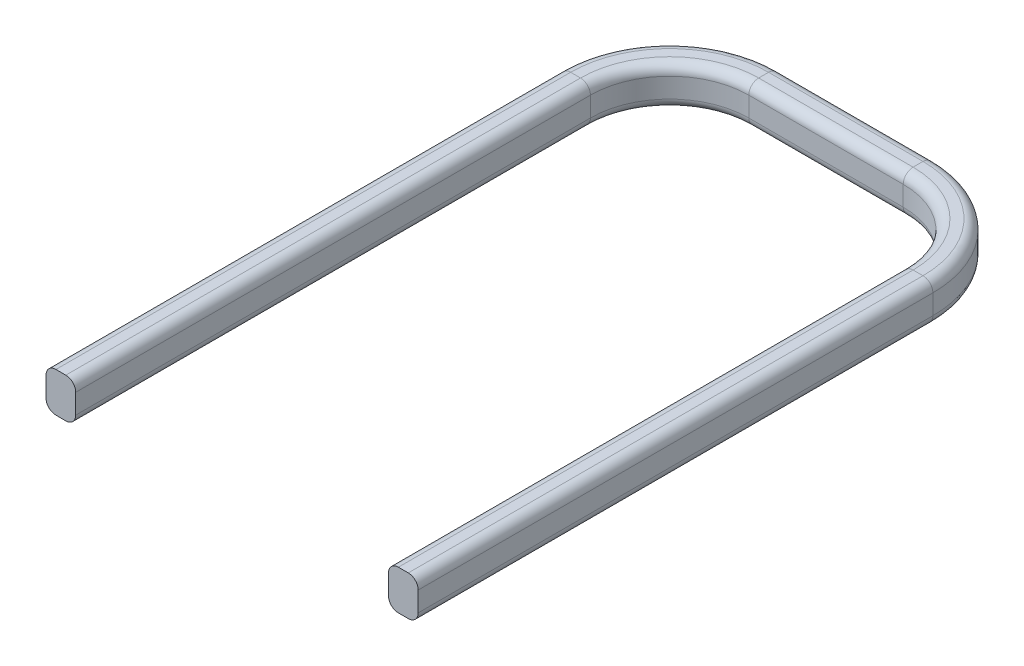
ISO-10303-21;
HEADER;
FILE_DESCRIPTION(('STEP AP214'),'2;1');
FILE_NAME('part.step','',(''),(''),'','','');
FILE_SCHEMA(('AUTOMOTIVE_DESIGN { 1 0 10303 214 1 1 1 1 }'));
ENDSEC;
DATA;
#1=APPLICATION_CONTEXT('core data for automotive mechanical design processes');
#2=APPLICATION_PROTOCOL_DEFINITION('international standard','automotive_design',2000,#1);
#3=PRODUCT_CONTEXT('',#1,'mechanical');
#4=PRODUCT('Part','Part','',(#3));
#5=PRODUCT_RELATED_PRODUCT_CATEGORY('part','',(#4));
#6=PRODUCT_DEFINITION_FORMATION('','',#4);
#7=PRODUCT_DEFINITION_CONTEXT('part definition',#1,'design');
#8=PRODUCT_DEFINITION('design','',#6,#7);
#9=PRODUCT_DEFINITION_SHAPE('','',#8);
#10=(LENGTH_UNIT() NAMED_UNIT(*) SI_UNIT(.MILLI.,.METRE.));
#11=(NAMED_UNIT(*) PLANE_ANGLE_UNIT() SI_UNIT($,.RADIAN.));
#12=(NAMED_UNIT(*) SI_UNIT($,.STERADIAN.) SOLID_ANGLE_UNIT());
#13=UNCERTAINTY_MEASURE_WITH_UNIT(LENGTH_MEASURE(1.E-05),#10,'distance_accuracy_value','');
#14=(GEOMETRIC_REPRESENTATION_CONTEXT(3) GLOBAL_UNCERTAINTY_ASSIGNED_CONTEXT((#13)) GLOBAL_UNIT_ASSIGNED_CONTEXT((#10,
#11,#12)) REPRESENTATION_CONTEXT('',''));
#15=CARTESIAN_POINT('',(0.,0.,0.));
#16=DIRECTION('',(0.,0.,1.));
#17=DIRECTION('',(1.,0.,0.));
#18=AXIS2_PLACEMENT_3D('',#15,#16,#17);
#19=CARTESIAN_POINT('',(0.,0.,0.));
#20=DIRECTION('',(0.,0.,1.));
#21=DIRECTION('',(1.,0.,0.));
#22=AXIS2_PLACEMENT_3D('',#19,#20,#21);
#23=PLANE('',#22);
#24=DIRECTION('',(1.,0.,0.));
#25=VECTOR('',#24,1.);
#26=CARTESIAN_POINT('',(-3.95,1.,0.));
#27=LINE('',#26,#25);
#28=CARTESIAN_POINT('',(-4.45,1.,0.));
#29=VERTEX_POINT('',#28);
#30=CARTESIAN_POINT('',(-4.2,1.,0.));
#31=VERTEX_POINT('',#30);
#32=EDGE_CURVE('E468',#29,#31,#27,.T.);
#33=ORIENTED_EDGE('',*,*,#32,.F.);
#34=CARTESIAN_POINT('',(-4.45,0.75,0.));
#35=DIRECTION('',(0.,0.,1.));
#36=DIRECTION('',(1.,0.,0.));
#37=AXIS2_PLACEMENT_3D('',#34,#35,#36);
#38=CIRCLE('',#37,0.25);
#39=CARTESIAN_POINT('',(-4.7,0.75,0.));
#40=VERTEX_POINT('',#39);
#41=EDGE_CURVE('E288',#29,#40,#38,.T.);
#42=ORIENTED_EDGE('',*,*,#41,.T.);
#43=DIRECTION('',(0.,1.,0.));
#44=VECTOR('',#43,1.);
#45=CARTESIAN_POINT('',(-4.7,0.,0.));
#46=LINE('',#45,#44);
#47=CARTESIAN_POINT('',(-4.7,0.25,0.));
#48=VERTEX_POINT('',#47);
#49=EDGE_CURVE('E340',#48,#40,#46,.T.);
#50=ORIENTED_EDGE('',*,*,#49,.F.);
#51=CARTESIAN_POINT('',(-4.45,0.25,0.));
#52=DIRECTION('',(0.,0.,1.));
#53=DIRECTION('',(1.,0.,0.));
#54=AXIS2_PLACEMENT_3D('',#51,#52,#53);
#55=CIRCLE('',#54,0.25);
#56=CARTESIAN_POINT('',(-4.45,0.,0.));
#57=VERTEX_POINT('',#56);
#58=EDGE_CURVE('E284',#48,#57,#55,.T.);
#59=ORIENTED_EDGE('',*,*,#58,.T.);
#60=DIRECTION('',(-1.,0.,0.));
#61=VECTOR('',#60,1.);
#62=CARTESIAN_POINT('',(-3.95,0.,0.));
#63=LINE('',#62,#61);
#64=CARTESIAN_POINT('',(-4.2,0.,0.));
#65=VERTEX_POINT('',#64);
#66=EDGE_CURVE('E424',#65,#57,#63,.T.);
#67=ORIENTED_EDGE('',*,*,#66,.F.);
#68=CARTESIAN_POINT('',(-4.2,0.25,0.));
#69=DIRECTION('',(0.,0.,1.));
#70=DIRECTION('',(1.,0.,0.));
#71=AXIS2_PLACEMENT_3D('',#68,#69,#70);
#72=CIRCLE('',#71,0.25);
#73=CARTESIAN_POINT('',(-3.95,0.25,0.));
#74=VERTEX_POINT('',#73);
#75=EDGE_CURVE('E286',#65,#74,#72,.T.);
#76=ORIENTED_EDGE('',*,*,#75,.T.);
#77=DIRECTION('',(0.,-1.,0.));
#78=VECTOR('',#77,1.);
#79=CARTESIAN_POINT('',(-3.95,0.,0.));
#80=LINE('',#79,#78);
#81=CARTESIAN_POINT('',(-3.95,0.75,0.));
#82=VERTEX_POINT('',#81);
#83=EDGE_CURVE('E427',#82,#74,#80,.T.);
#84=ORIENTED_EDGE('',*,*,#83,.F.);
#85=CARTESIAN_POINT('',(-4.2,0.75,0.));
#86=DIRECTION('',(0.,0.,1.));
#87=DIRECTION('',(1.,0.,0.));
#88=AXIS2_PLACEMENT_3D('',#85,#86,#87);
#89=CIRCLE('',#88,0.25);
#90=EDGE_CURVE('E282',#82,#31,#89,.T.);
#91=ORIENTED_EDGE('',*,*,#90,.T.);
#92=EDGE_LOOP('',(#33,#42,#50,#59,#67,#76,#84,#91));
#93=FACE_BOUND('',#92,.T.);
#94=ADVANCED_FACE('F43',(#93),#23,.T.);
#95=CARTESIAN_POINT('',(0.,0.,0.));
#96=DIRECTION('',(0.,0.,-1.));
#97=DIRECTION('',(-1.,0.,0.));
#98=AXIS2_PLACEMENT_3D('',#95,#96,#97);
#99=PLANE('',#98);
#100=DIRECTION('',(-1.,0.,0.));
#101=VECTOR('',#100,1.);
#102=CARTESIAN_POINT('',(3.95,1.,0.));
#103=LINE('',#102,#101);
#104=CARTESIAN_POINT('',(4.45,1.,0.));
#105=VERTEX_POINT('',#104);
#106=CARTESIAN_POINT('',(4.2,1.,0.));
#107=VERTEX_POINT('',#106);
#108=EDGE_CURVE('E210',#105,#107,#103,.T.);
#109=ORIENTED_EDGE('',*,*,#108,.T.);
#110=CARTESIAN_POINT('',(4.2,0.75,0.));
#111=DIRECTION('',(0.,0.,-1.));
#112=DIRECTION('',(-1.,0.,0.));
#113=AXIS2_PLACEMENT_3D('',#110,#111,#112);
#114=CIRCLE('',#113,0.25);
#115=CARTESIAN_POINT('',(3.95,0.75,0.));
#116=VERTEX_POINT('',#115);
#117=EDGE_CURVE('E216',#107,#116,#114,.F.);
#118=ORIENTED_EDGE('',*,*,#117,.T.);
#119=DIRECTION('',(0.,-1.,0.));
#120=VECTOR('',#119,1.);
#121=CARTESIAN_POINT('',(3.95,0.,0.));
#122=LINE('',#121,#120);
#123=CARTESIAN_POINT('',(3.95,0.25,0.));
#124=VERTEX_POINT('',#123);
#125=EDGE_CURVE('E227',#116,#124,#122,.T.);
#126=ORIENTED_EDGE('',*,*,#125,.T.);
#127=CARTESIAN_POINT('',(4.2,0.25,0.));
#128=DIRECTION('',(0.,0.,-1.));
#129=DIRECTION('',(-1.,0.,0.));
#130=AXIS2_PLACEMENT_3D('',#127,#128,#129);
#131=CIRCLE('',#130,0.25);
#132=CARTESIAN_POINT('',(4.2,0.,0.));
#133=VERTEX_POINT('',#132);
#134=EDGE_CURVE('E217',#124,#133,#131,.F.);
#135=ORIENTED_EDGE('',*,*,#134,.T.);
#136=DIRECTION('',(1.,0.,0.));
#137=VECTOR('',#136,1.);
#138=CARTESIAN_POINT('',(3.95,0.,0.));
#139=LINE('',#138,#137);
#140=CARTESIAN_POINT('',(4.45,0.,0.));
#141=VERTEX_POINT('',#140);
#142=EDGE_CURVE('E234',#133,#141,#139,.T.);
#143=ORIENTED_EDGE('',*,*,#142,.T.);
#144=CARTESIAN_POINT('',(4.45,0.25,0.));
#145=DIRECTION('',(0.,0.,-1.));
#146=DIRECTION('',(-1.,0.,0.));
#147=AXIS2_PLACEMENT_3D('',#144,#145,#146);
#148=CIRCLE('',#147,0.25);
#149=CARTESIAN_POINT('',(4.7,0.25,0.));
#150=VERTEX_POINT('',#149);
#151=EDGE_CURVE('E236',#141,#150,#148,.F.);
#152=ORIENTED_EDGE('',*,*,#151,.T.);
#153=DIRECTION('',(0.,1.,0.));
#154=VECTOR('',#153,1.);
#155=CARTESIAN_POINT('',(4.7,0.,0.));
#156=LINE('',#155,#154);
#157=CARTESIAN_POINT('',(4.7,0.75,0.));
#158=VERTEX_POINT('',#157);
#159=EDGE_CURVE('E212',#150,#158,#156,.T.);
#160=ORIENTED_EDGE('',*,*,#159,.T.);
#161=CARTESIAN_POINT('',(4.45,0.75,0.));
#162=DIRECTION('',(0.,0.,-1.));
#163=DIRECTION('',(-1.,0.,0.));
#164=AXIS2_PLACEMENT_3D('',#161,#162,#163);
#165=CIRCLE('',#164,0.25);
#166=EDGE_CURVE('E207',#158,#105,#165,.F.);
#167=ORIENTED_EDGE('',*,*,#166,.T.);
#168=EDGE_LOOP('',(#109,#118,#126,#135,#143,#152,#160,#167));
#169=FACE_BOUND('',#168,.T.);
#170=ADVANCED_FACE('F209',(#169),#99,.F.);
#171=CARTESIAN_POINT('',(-4.7,0.,0.));
#172=DIRECTION('',(-1.,0.,0.));
#173=DIRECTION('',(0.,0.,1.));
#174=AXIS2_PLACEMENT_3D('',#171,#172,#173);
#175=PLANE('',#174);
#176=ORIENTED_EDGE('',*,*,#49,.T.);
#177=DIRECTION('',(0.,0.,-1.));
#178=VECTOR('',#177,1.);
#179=CARTESIAN_POINT('',(-4.7,0.75,0.));
#180=LINE('',#179,#178);
#181=CARTESIAN_POINT('',(-4.7,0.75,-13.));
#182=VERTEX_POINT('',#181);
#183=EDGE_CURVE('E275',#40,#182,#180,.T.);
#184=ORIENTED_EDGE('',*,*,#183,.T.);
#185=DIRECTION('',(0.,1.,0.));
#186=VECTOR('',#185,1.);
#187=CARTESIAN_POINT('',(-4.7,0.,-13.));
#188=LINE('',#187,#186);
#189=CARTESIAN_POINT('',(-4.7,0.25,-13.));
#190=VERTEX_POINT('',#189);
#191=EDGE_CURVE('E426',#190,#182,#188,.T.);
#192=ORIENTED_EDGE('',*,*,#191,.F.);
#193=DIRECTION('',(0.,0.,-1.));
#194=VECTOR('',#193,1.);
#195=CARTESIAN_POINT('',(-4.7,0.25,0.));
#196=LINE('',#195,#194);
#197=EDGE_CURVE('E273',#190,#48,#196,.F.);
#198=ORIENTED_EDGE('',*,*,#197,.T.);
#199=EDGE_LOOP('',(#176,#184,#192,#198));
#200=FACE_BOUND('',#199,.T.);
#201=ADVANCED_FACE('F487',(#200),#175,.T.);
#202=CARTESIAN_POINT('',(-3.95,1.,0.));
#203=DIRECTION('',(0.,1.,0.));
#204=DIRECTION('',(0.,0.,1.));
#205=AXIS2_PLACEMENT_3D('',#202,#203,#204);
#206=PLANE('',#205);
#207=DIRECTION('',(1.,0.,0.));
#208=VECTOR('',#207,1.);
#209=CARTESIAN_POINT('',(-3.95,1.,-13.));
#210=LINE('',#209,#208);
#211=CARTESIAN_POINT('',(-4.45,1.,-13.));
#212=VERTEX_POINT('',#211);
#213=CARTESIAN_POINT('',(-4.2,1.,-13.));
#214=VERTEX_POINT('',#213);
#215=EDGE_CURVE('E438',#212,#214,#210,.T.);
#216=ORIENTED_EDGE('',*,*,#215,.F.);
#217=DIRECTION('',(0.,0.,-1.));
#218=VECTOR('',#217,1.);
#219=CARTESIAN_POINT('',(-4.45,1.,0.));
#220=LINE('',#219,#218);
#221=EDGE_CURVE('E280',#212,#29,#220,.F.);
#222=ORIENTED_EDGE('',*,*,#221,.T.);
#223=ORIENTED_EDGE('',*,*,#32,.T.);
#224=DIRECTION('',(0.,0.,-1.));
#225=VECTOR('',#224,1.);
#226=CARTESIAN_POINT('',(-4.2,1.,0.));
#227=LINE('',#226,#225);
#228=EDGE_CURVE('E278',#31,#214,#227,.T.);
#229=ORIENTED_EDGE('',*,*,#228,.T.);
#230=EDGE_LOOP('',(#216,#222,#223,#229));
#231=FACE_BOUND('',#230,.T.);
#232=ADVANCED_FACE('F518',(#231),#206,.T.);
#233=CARTESIAN_POINT('',(-3.95,0.,0.));
#234=DIRECTION('',(1.,0.,0.));
#235=DIRECTION('',(0.,0.,-1.));
#236=AXIS2_PLACEMENT_3D('',#233,#234,#235);
#237=PLANE('',#236);
#238=ORIENTED_EDGE('',*,*,#83,.T.);
#239=DIRECTION('',(0.,0.,-1.));
#240=VECTOR('',#239,1.);
#241=CARTESIAN_POINT('',(-3.95,0.25,0.));
#242=LINE('',#241,#240);
#243=CARTESIAN_POINT('',(-3.95,0.25,-13.));
#244=VERTEX_POINT('',#243);
#245=EDGE_CURVE('E304',#74,#244,#242,.T.);
#246=ORIENTED_EDGE('',*,*,#245,.T.);
#247=DIRECTION('',(0.,-1.,0.));
#248=VECTOR('',#247,1.);
#249=CARTESIAN_POINT('',(-3.95,0.,-13.));
#250=LINE('',#249,#248);
#251=CARTESIAN_POINT('',(-3.95,0.75,-13.));
#252=VERTEX_POINT('',#251);
#253=EDGE_CURVE('E431',#252,#244,#250,.T.);
#254=ORIENTED_EDGE('',*,*,#253,.F.);
#255=DIRECTION('',(0.,0.,-1.));
#256=VECTOR('',#255,1.);
#257=CARTESIAN_POINT('',(-3.95,0.75,0.));
#258=LINE('',#257,#256);
#259=EDGE_CURVE('E302',#252,#82,#258,.F.);
#260=ORIENTED_EDGE('',*,*,#259,.T.);
#261=EDGE_LOOP('',(#238,#246,#254,#260));
#262=FACE_BOUND('',#261,.T.);
#263=ADVANCED_FACE('F510',(#262),#237,.T.);
#264=CARTESIAN_POINT('',(-3.95,0.,0.));
#265=DIRECTION('',(0.,-1.,0.));
#266=DIRECTION('',(0.,0.,-1.));
#267=AXIS2_PLACEMENT_3D('',#264,#265,#266);
#268=PLANE('',#267);
#269=DIRECTION('',(-1.,0.,0.));
#270=VECTOR('',#269,1.);
#271=CARTESIAN_POINT('',(-3.95,0.,-13.));
#272=LINE('',#271,#270);
#273=CARTESIAN_POINT('',(-4.2,0.,-13.));
#274=VERTEX_POINT('',#273);
#275=CARTESIAN_POINT('',(-4.45,0.,-13.));
#276=VERTEX_POINT('',#275);
#277=EDGE_CURVE('E428',#274,#276,#272,.T.);
#278=ORIENTED_EDGE('',*,*,#277,.F.);
#279=DIRECTION('',(0.,0.,-1.));
#280=VECTOR('',#279,1.);
#281=CARTESIAN_POINT('',(-4.2,0.,0.));
#282=LINE('',#281,#280);
#283=EDGE_CURVE('E310',#274,#65,#282,.F.);
#284=ORIENTED_EDGE('',*,*,#283,.T.);
#285=ORIENTED_EDGE('',*,*,#66,.T.);
#286=DIRECTION('',(0.,0.,-1.));
#287=VECTOR('',#286,1.);
#288=CARTESIAN_POINT('',(-4.45,0.,0.));
#289=LINE('',#288,#287);
#290=EDGE_CURVE('E307',#57,#276,#289,.T.);
#291=ORIENTED_EDGE('',*,*,#290,.T.);
#292=EDGE_LOOP('',(#278,#284,#285,#291));
#293=FACE_BOUND('',#292,.T.);
#294=ADVANCED_FACE('F498',(#293),#268,.T.);
#295=CARTESIAN_POINT('',(-1.95,0.,-13.));
#296=DIRECTION('',(0.,-1.,0.));
#297=DIRECTION('',(0.,0.,-1.));
#298=AXIS2_PLACEMENT_3D('',#295,#296,#297);
#299=CYLINDRICAL_SURFACE('',#298,2.75);
#300=ORIENTED_EDGE('',*,*,#191,.T.);
#301=CARTESIAN_POINT('',(-1.95,0.75,-13.));
#302=DIRECTION('',(0.,1.,0.));
#303=DIRECTION('',(0.,0.,1.));
#304=AXIS2_PLACEMENT_3D('',#301,#302,#303);
#305=CIRCLE('',#304,2.75);
#306=CARTESIAN_POINT('',(-1.95,0.75,-15.75));
#307=VERTEX_POINT('',#306);
#308=EDGE_CURVE('E292',#182,#307,#305,.F.);
#309=ORIENTED_EDGE('',*,*,#308,.T.);
#310=DIRECTION('',(0.,1.,0.));
#311=VECTOR('',#310,1.);
#312=CARTESIAN_POINT('',(-1.95,0.,-15.75));
#313=LINE('',#312,#311);
#314=CARTESIAN_POINT('',(-1.95,0.25,-15.75));
#315=VERTEX_POINT('',#314);
#316=EDGE_CURVE('E430',#315,#307,#313,.T.);
#317=ORIENTED_EDGE('',*,*,#316,.F.);
#318=CARTESIAN_POINT('',(-1.95,0.25,-13.));
#319=DIRECTION('',(0.,-1.,0.));
#320=DIRECTION('',(0.,0.,-1.));
#321=AXIS2_PLACEMENT_3D('',#318,#319,#320);
#322=CIRCLE('',#321,2.75);
#323=EDGE_CURVE('E290',#315,#190,#322,.F.);
#324=ORIENTED_EDGE('',*,*,#323,.T.);
#325=EDGE_LOOP('',(#300,#309,#317,#324));
#326=FACE_BOUND('',#325,.T.);
#327=ADVANCED_FACE('F482',(#326),#299,.T.);
#328=CARTESIAN_POINT('',(-3.95,1.,-13.));
#329=DIRECTION('',(0.,1.,0.));
#330=DIRECTION('',(0.,0.,1.));
#331=AXIS2_PLACEMENT_3D('',#328,#329,#330);
#332=PLANE('',#331);
#333=ORIENTED_EDGE('',*,*,#215,.T.);
#334=CARTESIAN_POINT('',(-1.95,1.,-13.));
#335=DIRECTION('',(0.,1.,0.));
#336=DIRECTION('',(0.,0.,1.));
#337=AXIS2_PLACEMENT_3D('',#334,#335,#336);
#338=CIRCLE('',#337,2.25);
#339=CARTESIAN_POINT('',(-1.95,1.,-15.25));
#340=VERTEX_POINT('',#339);
#341=EDGE_CURVE('E267',#214,#340,#338,.F.);
#342=ORIENTED_EDGE('',*,*,#341,.T.);
#343=DIRECTION('',(0.,0.,1.));
#344=VECTOR('',#343,1.);
#345=CARTESIAN_POINT('',(-1.95,1.,-15.));
#346=LINE('',#345,#344);
#347=CARTESIAN_POINT('',(-1.95,1.,-15.5));
#348=VERTEX_POINT('',#347);
#349=EDGE_CURVE('E435',#348,#340,#346,.T.);
#350=ORIENTED_EDGE('',*,*,#349,.F.);
#351=CARTESIAN_POINT('',(-1.95,1.,-13.));
#352=DIRECTION('',(0.,1.,0.));
#353=DIRECTION('',(0.,0.,1.));
#354=AXIS2_PLACEMENT_3D('',#351,#352,#353);
#355=CIRCLE('',#354,2.5);
#356=EDGE_CURVE('E265',#348,#212,#355,.T.);
#357=ORIENTED_EDGE('',*,*,#356,.T.);
#358=EDGE_LOOP('',(#333,#342,#350,#357));
#359=FACE_BOUND('',#358,.T.);
#360=ADVANCED_FACE('F521',(#359),#332,.T.);
#361=CARTESIAN_POINT('',(-1.95,0.,-13.));
#362=DIRECTION('',(0.,-1.,0.));
#363=DIRECTION('',(0.,0.,-1.));
#364=AXIS2_PLACEMENT_3D('',#361,#362,#363);
#365=CYLINDRICAL_SURFACE('',#364,2.);
#366=DIRECTION('',(0.,-1.,0.));
#367=VECTOR('',#366,1.);
#368=CARTESIAN_POINT('',(-1.95,0.,-15.));
#369=LINE('',#368,#367);
#370=CARTESIAN_POINT('',(-1.95,0.75,-15.));
#371=VERTEX_POINT('',#370);
#372=CARTESIAN_POINT('',(-1.95,0.25,-15.));
#373=VERTEX_POINT('',#372);
#374=EDGE_CURVE('E445',#371,#373,#369,.T.);
#375=ORIENTED_EDGE('',*,*,#374,.F.);
#376=CARTESIAN_POINT('',(-1.95,0.75,-13.));
#377=DIRECTION('',(0.,1.,0.));
#378=DIRECTION('',(0.,0.,1.));
#379=AXIS2_PLACEMENT_3D('',#376,#377,#378);
#380=CIRCLE('',#379,2.);
#381=EDGE_CURVE('E271',#371,#252,#380,.T.);
#382=ORIENTED_EDGE('',*,*,#381,.T.);
#383=ORIENTED_EDGE('',*,*,#253,.T.);
#384=CARTESIAN_POINT('',(-1.95,0.25,-13.));
#385=DIRECTION('',(0.,-1.,0.));
#386=DIRECTION('',(0.,0.,-1.));
#387=AXIS2_PLACEMENT_3D('',#384,#385,#386);
#388=CIRCLE('',#387,2.);
#389=EDGE_CURVE('E269',#244,#373,#388,.T.);
#390=ORIENTED_EDGE('',*,*,#389,.T.);
#391=EDGE_LOOP('',(#375,#382,#383,#390));
#392=FACE_BOUND('',#391,.T.);
#393=ADVANCED_FACE('F813',(#392),#365,.F.);
#394=CARTESIAN_POINT('',(-3.95,0.,-13.));
#395=DIRECTION('',(0.,-1.,0.));
#396=DIRECTION('',(0.,0.,-1.));
#397=AXIS2_PLACEMENT_3D('',#394,#395,#396);
#398=PLANE('',#397);
#399=DIRECTION('',(0.,0.,-1.));
#400=VECTOR('',#399,1.);
#401=CARTESIAN_POINT('',(-1.95,0.,-15.));
#402=LINE('',#401,#400);
#403=CARTESIAN_POINT('',(-1.95,0.,-15.25));
#404=VERTEX_POINT('',#403);
#405=CARTESIAN_POINT('',(-1.95,0.,-15.5));
#406=VERTEX_POINT('',#405);
#407=EDGE_CURVE('E412',#404,#406,#402,.T.);
#408=ORIENTED_EDGE('',*,*,#407,.F.);
#409=CARTESIAN_POINT('',(-1.95,0.,-13.));
#410=DIRECTION('',(0.,-1.,0.));
#411=DIRECTION('',(0.,0.,-1.));
#412=AXIS2_PLACEMENT_3D('',#409,#410,#411);
#413=CIRCLE('',#412,2.25);
#414=EDGE_CURVE('E314',#404,#274,#413,.F.);
#415=ORIENTED_EDGE('',*,*,#414,.T.);
#416=ORIENTED_EDGE('',*,*,#277,.T.);
#417=CARTESIAN_POINT('',(-1.95,0.,-13.));
#418=DIRECTION('',(0.,-1.,0.));
#419=DIRECTION('',(0.,0.,-1.));
#420=AXIS2_PLACEMENT_3D('',#417,#418,#419);
#421=CIRCLE('',#420,2.5);
#422=EDGE_CURVE('E312',#276,#406,#421,.T.);
#423=ORIENTED_EDGE('',*,*,#422,.T.);
#424=EDGE_LOOP('',(#408,#415,#416,#423));
#425=FACE_BOUND('',#424,.T.);
#426=ADVANCED_FACE('F805',(#425),#398,.T.);
#427=CARTESIAN_POINT('',(-1.95,0.,-15.75));
#428=DIRECTION('',(0.,0.,-1.));
#429=DIRECTION('',(-1.,0.,0.));
#430=AXIS2_PLACEMENT_3D('',#427,#428,#429);
#431=PLANE('',#430);
#432=ORIENTED_EDGE('',*,*,#316,.T.);
#433=DIRECTION('',(1.,0.,0.));
#434=VECTOR('',#433,1.);
#435=CARTESIAN_POINT('',(-1.95,0.75,-15.75));
#436=LINE('',#435,#434);
#437=CARTESIAN_POINT('',(1.94999999999999,0.75,-15.75));
#438=VERTEX_POINT('',#437);
#439=EDGE_CURVE('E296',#307,#438,#436,.T.);
#440=ORIENTED_EDGE('',*,*,#439,.T.);
#441=DIRECTION('',(0.,1.,0.));
#442=VECTOR('',#441,1.);
#443=CARTESIAN_POINT('',(1.94999999999999,0.,-15.75));
#444=LINE('',#443,#442);
#445=CARTESIAN_POINT('',(1.94999999999999,0.25,-15.75));
#446=VERTEX_POINT('',#445);
#447=EDGE_CURVE('E450',#446,#438,#444,.T.);
#448=ORIENTED_EDGE('',*,*,#447,.F.);
#449=DIRECTION('',(1.,0.,0.));
#450=VECTOR('',#449,1.);
#451=CARTESIAN_POINT('',(-1.95,0.25,-15.75));
#452=LINE('',#451,#450);
#453=EDGE_CURVE('E294',#446,#315,#452,.F.);
#454=ORIENTED_EDGE('',*,*,#453,.T.);
#455=EDGE_LOOP('',(#432,#440,#448,#454));
#456=FACE_BOUND('',#455,.T.);
#457=ADVANCED_FACE('F584',(#456),#431,.T.);
#458=CARTESIAN_POINT('',(-1.95,1.,-15.));
#459=DIRECTION('',(0.,1.,0.));
#460=DIRECTION('',(0.,0.,1.));
#461=AXIS2_PLACEMENT_3D('',#458,#459,#460);
#462=PLANE('',#461);
#463=ORIENTED_EDGE('',*,*,#349,.T.);
#464=DIRECTION('',(1.,0.,0.));
#465=VECTOR('',#464,1.);
#466=CARTESIAN_POINT('',(-1.95,1.,-15.25));
#467=LINE('',#466,#465);
#468=CARTESIAN_POINT('',(1.94999999999999,1.,-15.25));
#469=VERTEX_POINT('',#468);
#470=EDGE_CURVE('E259',#340,#469,#467,.T.);
#471=ORIENTED_EDGE('',*,*,#470,.T.);
#472=DIRECTION('',(0.,0.,1.));
#473=VECTOR('',#472,1.);
#474=CARTESIAN_POINT('',(1.94999999999999,1.,-15.));
#475=LINE('',#474,#473);
#476=CARTESIAN_POINT('',(1.94999999999999,1.,-15.5));
#477=VERTEX_POINT('',#476);
#478=EDGE_CURVE('E409',#477,#469,#475,.T.);
#479=ORIENTED_EDGE('',*,*,#478,.F.);
#480=DIRECTION('',(1.,0.,0.));
#481=VECTOR('',#480,1.);
#482=CARTESIAN_POINT('',(-1.95,1.,-15.5));
#483=LINE('',#482,#481);
#484=EDGE_CURVE('E257',#477,#348,#483,.F.);
#485=ORIENTED_EDGE('',*,*,#484,.T.);
#486=EDGE_LOOP('',(#463,#471,#479,#485));
#487=FACE_BOUND('',#486,.T.);
#488=ADVANCED_FACE('F576',(#487),#462,.T.);
#489=CARTESIAN_POINT('',(-1.95,0.,-15.));
#490=DIRECTION('',(0.,0.,1.));
#491=DIRECTION('',(1.,0.,0.));
#492=AXIS2_PLACEMENT_3D('',#489,#490,#491);
#493=PLANE('',#492);
#494=DIRECTION('',(0.,-1.,0.));
#495=VECTOR('',#494,1.);
#496=CARTESIAN_POINT('',(1.94999999999999,0.,-15.));
#497=LINE('',#496,#495);
#498=CARTESIAN_POINT('',(1.94999999999999,0.75,-15.));
#499=VERTEX_POINT('',#498);
#500=CARTESIAN_POINT('',(1.94999999999999,0.25,-15.));
#501=VERTEX_POINT('',#500);
#502=EDGE_CURVE('E403',#499,#501,#497,.T.);
#503=ORIENTED_EDGE('',*,*,#502,.F.);
#504=DIRECTION('',(1.,0.,0.));
#505=VECTOR('',#504,1.);
#506=CARTESIAN_POINT('',(-1.95,0.75,-15.));
#507=LINE('',#506,#505);
#508=EDGE_CURVE('E263',#499,#371,#507,.F.);
#509=ORIENTED_EDGE('',*,*,#508,.T.);
#510=ORIENTED_EDGE('',*,*,#374,.T.);
#511=DIRECTION('',(1.,0.,0.));
#512=VECTOR('',#511,1.);
#513=CARTESIAN_POINT('',(-1.95,0.25,-15.));
#514=LINE('',#513,#512);
#515=EDGE_CURVE('E261',#373,#501,#514,.T.);
#516=ORIENTED_EDGE('',*,*,#515,.T.);
#517=EDGE_LOOP('',(#503,#509,#510,#516));
#518=FACE_BOUND('',#517,.T.);
#519=ADVANCED_FACE('F784',(#518),#493,.T.);
#520=CARTESIAN_POINT('',(-1.95,0.,-15.));
#521=DIRECTION('',(0.,-1.,0.));
#522=DIRECTION('',(0.,0.,-1.));
#523=AXIS2_PLACEMENT_3D('',#520,#521,#522);
#524=PLANE('',#523);
#525=DIRECTION('',(0.,0.,-1.));
#526=VECTOR('',#525,1.);
#527=CARTESIAN_POINT('',(1.94999999999999,0.,-15.));
#528=LINE('',#527,#526);
#529=CARTESIAN_POINT('',(1.94999999999999,0.,-15.25));
#530=VERTEX_POINT('',#529);
#531=CARTESIAN_POINT('',(1.94999999999999,0.,-15.5));
#532=VERTEX_POINT('',#531);
#533=EDGE_CURVE('E397',#530,#532,#528,.T.);
#534=ORIENTED_EDGE('',*,*,#533,.F.);
#535=DIRECTION('',(1.,0.,0.));
#536=VECTOR('',#535,1.);
#537=CARTESIAN_POINT('',(-1.95,0.,-15.25));
#538=LINE('',#537,#536);
#539=EDGE_CURVE('E318',#530,#404,#538,.F.);
#540=ORIENTED_EDGE('',*,*,#539,.T.);
#541=ORIENTED_EDGE('',*,*,#407,.T.);
#542=DIRECTION('',(1.,0.,0.));
#543=VECTOR('',#542,1.);
#544=CARTESIAN_POINT('',(-1.95,0.,-15.5));
#545=LINE('',#544,#543);
#546=EDGE_CURVE('E316',#406,#532,#545,.T.);
#547=ORIENTED_EDGE('',*,*,#546,.T.);
#548=EDGE_LOOP('',(#534,#540,#541,#547));
#549=FACE_BOUND('',#548,.T.);
#550=ADVANCED_FACE('F399',(#549),#524,.T.);
#551=CARTESIAN_POINT('',(1.95,0.,-13.));
#552=DIRECTION('',(0.,-1.,0.));
#553=DIRECTION('',(0.,0.,-1.));
#554=AXIS2_PLACEMENT_3D('',#551,#552,#553);
#555=CYLINDRICAL_SURFACE('',#554,2.75);
#556=ORIENTED_EDGE('',*,*,#447,.T.);
#557=CARTESIAN_POINT('',(1.95,0.75,-13.));
#558=DIRECTION('',(0.,1.,0.));
#559=DIRECTION('',(0.,0.,1.));
#560=AXIS2_PLACEMENT_3D('',#557,#558,#559);
#561=CIRCLE('',#560,2.75);
#562=CARTESIAN_POINT('',(4.7,0.75,-13.));
#563=VERTEX_POINT('',#562);
#564=EDGE_CURVE('E300',#438,#563,#561,.F.);
#565=ORIENTED_EDGE('',*,*,#564,.T.);
#566=DIRECTION('',(0.,1.,0.));
#567=VECTOR('',#566,1.);
#568=CARTESIAN_POINT('',(4.7,0.,-13.));
#569=LINE('',#568,#567);
#570=CARTESIAN_POINT('',(4.7,0.25,-13.));
#571=VERTEX_POINT('',#570);
#572=EDGE_CURVE('E402',#571,#563,#569,.T.);
#573=ORIENTED_EDGE('',*,*,#572,.F.);
#574=CARTESIAN_POINT('',(1.95,0.25,-13.));
#575=DIRECTION('',(0.,-1.,0.));
#576=DIRECTION('',(0.,0.,-1.));
#577=AXIS2_PLACEMENT_3D('',#574,#575,#576);
#578=CIRCLE('',#577,2.75);
#579=EDGE_CURVE('E298',#571,#446,#578,.F.);
#580=ORIENTED_EDGE('',*,*,#579,.T.);
#581=EDGE_LOOP('',(#556,#565,#573,#580));
#582=FACE_BOUND('',#581,.T.);
#583=ADVANCED_FACE('F769',(#582),#555,.T.);
#584=CARTESIAN_POINT('',(1.94999999999999,1.,-15.));
#585=DIRECTION('',(0.,1.,0.));
#586=DIRECTION('',(0.,0.,1.));
#587=AXIS2_PLACEMENT_3D('',#584,#585,#586);
#588=PLANE('',#587);
#589=ORIENTED_EDGE('',*,*,#478,.T.);
#590=CARTESIAN_POINT('',(1.95,1.,-13.));
#591=DIRECTION('',(0.,1.,0.));
#592=DIRECTION('',(0.,0.,1.));
#593=AXIS2_PLACEMENT_3D('',#590,#591,#592);
#594=CIRCLE('',#593,2.25);
#595=CARTESIAN_POINT('',(4.2,1.,-13.));
#596=VERTEX_POINT('',#595);
#597=EDGE_CURVE('E251',#469,#596,#594,.F.);
#598=ORIENTED_EDGE('',*,*,#597,.T.);
#599=DIRECTION('',(-1.,0.,0.));
#600=VECTOR('',#599,1.);
#601=CARTESIAN_POINT('',(3.95,1.,-13.));
#602=LINE('',#601,#600);
#603=CARTESIAN_POINT('',(4.45,1.,-13.));
#604=VERTEX_POINT('',#603);
#605=EDGE_CURVE('E406',#604,#596,#602,.T.);
#606=ORIENTED_EDGE('',*,*,#605,.F.);
#607=CARTESIAN_POINT('',(1.95,1.,-13.));
#608=DIRECTION('',(0.,1.,0.));
#609=DIRECTION('',(0.,0.,1.));
#610=AXIS2_PLACEMENT_3D('',#607,#608,#609);
#611=CIRCLE('',#610,2.5);
#612=EDGE_CURVE('E249',#604,#477,#611,.T.);
#613=ORIENTED_EDGE('',*,*,#612,.T.);
#614=EDGE_LOOP('',(#589,#598,#606,#613));
#615=FACE_BOUND('',#614,.T.);
#616=ADVANCED_FACE('F760',(#615),#588,.T.);
#617=CARTESIAN_POINT('',(1.95,0.,-13.));
#618=DIRECTION('',(0.,-1.,0.));
#619=DIRECTION('',(0.,0.,-1.));
#620=AXIS2_PLACEMENT_3D('',#617,#618,#619);
#621=CYLINDRICAL_SURFACE('',#620,2.);
#622=DIRECTION('',(0.,-1.,0.));
#623=VECTOR('',#622,1.);
#624=CARTESIAN_POINT('',(3.95,0.,-13.));
#625=LINE('',#624,#623);
#626=CARTESIAN_POINT('',(3.95,0.75,-13.));
#627=VERTEX_POINT('',#626);
#628=CARTESIAN_POINT('',(3.95,0.25,-13.));
#629=VERTEX_POINT('',#628);
#630=EDGE_CURVE('E414',#627,#629,#625,.T.);
#631=ORIENTED_EDGE('',*,*,#630,.F.);
#632=CARTESIAN_POINT('',(1.95,0.75,-13.));
#633=DIRECTION('',(0.,1.,0.));
#634=DIRECTION('',(0.,0.,1.));
#635=AXIS2_PLACEMENT_3D('',#632,#633,#634);
#636=CIRCLE('',#635,2.);
#637=EDGE_CURVE('E255',#627,#499,#636,.T.);
#638=ORIENTED_EDGE('',*,*,#637,.T.);
#639=ORIENTED_EDGE('',*,*,#502,.T.);
#640=CARTESIAN_POINT('',(1.95,0.25,-13.));
#641=DIRECTION('',(0.,-1.,0.));
#642=DIRECTION('',(0.,0.,-1.));
#643=AXIS2_PLACEMENT_3D('',#640,#641,#642);
#644=CIRCLE('',#643,2.);
#645=EDGE_CURVE('E253',#501,#629,#644,.T.);
#646=ORIENTED_EDGE('',*,*,#645,.T.);
#647=EDGE_LOOP('',(#631,#638,#639,#646));
#648=FACE_BOUND('',#647,.T.);
#649=ADVANCED_FACE('F753',(#648),#621,.F.);
#650=CARTESIAN_POINT('',(1.94999999999999,0.,-15.));
#651=DIRECTION('',(0.,-1.,0.));
#652=DIRECTION('',(0.,0.,-1.));
#653=AXIS2_PLACEMENT_3D('',#650,#651,#652);
#654=PLANE('',#653);
#655=DIRECTION('',(1.,0.,0.));
#656=VECTOR('',#655,1.);
#657=CARTESIAN_POINT('',(3.95,0.,-13.));
#658=LINE('',#657,#656);
#659=CARTESIAN_POINT('',(4.2,0.,-13.));
#660=VERTEX_POINT('',#659);
#661=CARTESIAN_POINT('',(4.45,0.,-13.));
#662=VERTEX_POINT('',#661);
#663=EDGE_CURVE('E381',#660,#662,#658,.T.);
#664=ORIENTED_EDGE('',*,*,#663,.F.);
#665=CARTESIAN_POINT('',(1.95,0.,-13.));
#666=DIRECTION('',(0.,-1.,0.));
#667=DIRECTION('',(0.,0.,-1.));
#668=AXIS2_PLACEMENT_3D('',#665,#666,#667);
#669=CIRCLE('',#668,2.25);
#670=EDGE_CURVE('E321',#660,#530,#669,.F.);
#671=ORIENTED_EDGE('',*,*,#670,.T.);
#672=ORIENTED_EDGE('',*,*,#533,.T.);
#673=CARTESIAN_POINT('',(1.95,0.,-13.));
#674=DIRECTION('',(0.,-1.,0.));
#675=DIRECTION('',(0.,0.,-1.));
#676=AXIS2_PLACEMENT_3D('',#673,#674,#675);
#677=CIRCLE('',#676,2.5);
#678=EDGE_CURVE('E60',#532,#662,#677,.T.);
#679=ORIENTED_EDGE('',*,*,#678,.T.);
#680=EDGE_LOOP('',(#664,#671,#672,#679));
#681=FACE_BOUND('',#680,.T.);
#682=ADVANCED_FACE('F396',(#681),#654,.T.);
#683=CARTESIAN_POINT('',(4.7,0.,-13.));
#684=DIRECTION('',(1.,0.,0.));
#685=DIRECTION('',(0.,0.,-1.));
#686=AXIS2_PLACEMENT_3D('',#683,#684,#685);
#687=PLANE('',#686);
#688=ORIENTED_EDGE('',*,*,#572,.T.);
#689=DIRECTION('',(0.,0.,1.));
#690=VECTOR('',#689,1.);
#691=CARTESIAN_POINT('',(4.7,0.75,-13.));
#692=LINE('',#691,#690);
#693=EDGE_CURVE('E325',#563,#158,#692,.T.);
#694=ORIENTED_EDGE('',*,*,#693,.T.);
#695=ORIENTED_EDGE('',*,*,#159,.F.);
#696=DIRECTION('',(0.,0.,1.));
#697=VECTOR('',#696,1.);
#698=CARTESIAN_POINT('',(4.7,0.25,-13.));
#699=LINE('',#698,#697);
#700=EDGE_CURVE('E323',#150,#571,#699,.F.);
#701=ORIENTED_EDGE('',*,*,#700,.T.);
#702=EDGE_LOOP('',(#688,#694,#695,#701));
#703=FACE_BOUND('',#702,.T.);
#704=ADVANCED_FACE('F737',(#703),#687,.T.);
#705=CARTESIAN_POINT('',(3.95,1.,-13.));
#706=DIRECTION('',(0.,1.,0.));
#707=DIRECTION('',(0.,0.,1.));
#708=AXIS2_PLACEMENT_3D('',#705,#706,#707);
#709=PLANE('',#708);
#710=ORIENTED_EDGE('',*,*,#605,.T.);
#711=DIRECTION('',(0.,0.,1.));
#712=VECTOR('',#711,1.);
#713=CARTESIAN_POINT('',(4.2,1.,-13.));
#714=LINE('',#713,#712);
#715=EDGE_CURVE('E226',#596,#107,#714,.T.);
#716=ORIENTED_EDGE('',*,*,#715,.T.);
#717=ORIENTED_EDGE('',*,*,#108,.F.);
#718=DIRECTION('',(0.,0.,1.));
#719=VECTOR('',#718,1.);
#720=CARTESIAN_POINT('',(4.45,1.,-13.));
#721=LINE('',#720,#719);
#722=EDGE_CURVE('E223',#105,#604,#721,.F.);
#723=ORIENTED_EDGE('',*,*,#722,.T.);
#724=EDGE_LOOP('',(#710,#716,#717,#723));
#725=FACE_BOUND('',#724,.T.);
#726=ADVANCED_FACE('F222',(#725),#709,.T.);
#727=CARTESIAN_POINT('',(3.95,0.,-13.));
#728=DIRECTION('',(-1.,0.,0.));
#729=DIRECTION('',(0.,0.,1.));
#730=AXIS2_PLACEMENT_3D('',#727,#728,#729);
#731=PLANE('',#730);
#732=ORIENTED_EDGE('',*,*,#125,.F.);
#733=DIRECTION('',(0.,0.,1.));
#734=VECTOR('',#733,1.);
#735=CARTESIAN_POINT('',(3.95,0.75,-13.));
#736=LINE('',#735,#734);
#737=EDGE_CURVE('E247',#116,#627,#736,.F.);
#738=ORIENTED_EDGE('',*,*,#737,.T.);
#739=ORIENTED_EDGE('',*,*,#630,.T.);
#740=DIRECTION('',(0.,0.,1.));
#741=VECTOR('',#740,1.);
#742=CARTESIAN_POINT('',(3.95,0.25,-13.));
#743=LINE('',#742,#741);
#744=EDGE_CURVE('E245',#629,#124,#743,.T.);
#745=ORIENTED_EDGE('',*,*,#744,.T.);
#746=EDGE_LOOP('',(#732,#738,#739,#745));
#747=FACE_BOUND('',#746,.T.);
#748=ADVANCED_FACE('F541',(#747),#731,.T.);
#749=CARTESIAN_POINT('',(3.95,0.,-13.));
#750=DIRECTION('',(0.,-1.,0.));
#751=DIRECTION('',(0.,0.,-1.));
#752=AXIS2_PLACEMENT_3D('',#749,#750,#751);
#753=PLANE('',#752);
#754=ORIENTED_EDGE('',*,*,#142,.F.);
#755=DIRECTION('',(0.,0.,1.));
#756=VECTOR('',#755,1.);
#757=CARTESIAN_POINT('',(4.2,0.,-13.));
#758=LINE('',#757,#756);
#759=EDGE_CURVE('E11',#133,#660,#758,.F.);
#760=ORIENTED_EDGE('',*,*,#759,.T.);
#761=ORIENTED_EDGE('',*,*,#663,.T.);
#762=DIRECTION('',(0.,0.,1.));
#763=VECTOR('',#762,1.);
#764=CARTESIAN_POINT('',(4.45,0.,-13.));
#765=LINE('',#764,#763);
#766=EDGE_CURVE('E52',#662,#141,#765,.T.);
#767=ORIENTED_EDGE('',*,*,#766,.T.);
#768=EDGE_LOOP('',(#754,#760,#761,#767));
#769=FACE_BOUND('',#768,.T.);
#770=ADVANCED_FACE('F380',(#769),#753,.T.);
#771=CARTESIAN_POINT('',(-4.2,0.75,0.));
#772=DIRECTION('',(0.,0.,-1.));
#773=DIRECTION('',(-1.,0.,0.));
#774=AXIS2_PLACEMENT_3D('',#771,#772,#773);
#775=CYLINDRICAL_SURFACE('',#774,0.25);
#776=ORIENTED_EDGE('',*,*,#90,.F.);
#777=ORIENTED_EDGE('',*,*,#259,.F.);
#778=CARTESIAN_POINT('',(-4.2,0.75,-13.));
#779=DIRECTION('',(0.,0.,-1.));
#780=DIRECTION('',(-1.,0.,0.));
#781=AXIS2_PLACEMENT_3D('',#778,#779,#780);
#782=CIRCLE('',#781,0.25);
#783=EDGE_CURVE('E337',#214,#252,#782,.T.);
#784=ORIENTED_EDGE('',*,*,#783,.F.);
#785=ORIENTED_EDGE('',*,*,#228,.F.);
#786=EDGE_LOOP('',(#776,#777,#784,#785));
#787=FACE_BOUND('',#786,.T.);
#788=ADVANCED_FACE('F514',(#787),#775,.T.);
#789=CARTESIAN_POINT('',(-1.95,0.75,-13.));
#790=DIRECTION('',(0.,1.,0.));
#791=DIRECTION('',(0.,0.,1.));
#792=AXIS2_PLACEMENT_3D('',#789,#790,#791);
#793=TOROIDAL_SURFACE('',#792,2.25,0.25);
#794=ORIENTED_EDGE('',*,*,#783,.T.);
#795=ORIENTED_EDGE('',*,*,#381,.F.);
#796=CARTESIAN_POINT('',(-1.95,0.75,-15.25));
#797=DIRECTION('',(1.,0.,0.));
#798=DIRECTION('',(0.,0.,-1.));
#799=AXIS2_PLACEMENT_3D('',#796,#797,#798);
#800=CIRCLE('',#799,0.25);
#801=EDGE_CURVE('E334',#340,#371,#800,.T.);
#802=ORIENTED_EDGE('',*,*,#801,.F.);
#803=ORIENTED_EDGE('',*,*,#341,.F.);
#804=EDGE_LOOP('',(#794,#795,#802,#803));
#805=FACE_BOUND('',#804,.T.);
#806=ADVANCED_FACE('F547',(#805),#793,.T.);
#807=CARTESIAN_POINT('',(-1.95,0.75,-15.25));
#808=DIRECTION('',(1.,0.,0.));
#809=DIRECTION('',(0.,0.,-1.));
#810=AXIS2_PLACEMENT_3D('',#807,#808,#809);
#811=CYLINDRICAL_SURFACE('',#810,0.25);
#812=ORIENTED_EDGE('',*,*,#801,.T.);
#813=ORIENTED_EDGE('',*,*,#508,.F.);
#814=CARTESIAN_POINT('',(1.94999999999999,0.75,-15.25));
#815=DIRECTION('',(1.,0.,0.));
#816=DIRECTION('',(0.,0.,-1.));
#817=AXIS2_PLACEMENT_3D('',#814,#815,#816);
#818=CIRCLE('',#817,0.25);
#819=EDGE_CURVE('E331',#469,#499,#818,.T.);
#820=ORIENTED_EDGE('',*,*,#819,.F.);
#821=ORIENTED_EDGE('',*,*,#470,.F.);
#822=EDGE_LOOP('',(#812,#813,#820,#821));
#823=FACE_BOUND('',#822,.T.);
#824=ADVANCED_FACE('F563',(#823),#811,.T.);
#825=CARTESIAN_POINT('',(1.95,0.75,-13.));
#826=DIRECTION('',(0.,1.,0.));
#827=DIRECTION('',(0.,0.,1.));
#828=AXIS2_PLACEMENT_3D('',#825,#826,#827);
#829=TOROIDAL_SURFACE('',#828,2.25,0.25);
#830=ORIENTED_EDGE('',*,*,#819,.T.);
#831=ORIENTED_EDGE('',*,*,#637,.F.);
#832=CARTESIAN_POINT('',(4.2,0.75,-13.));
#833=DIRECTION('',(0.,0.,1.));
#834=DIRECTION('',(1.,0.,0.));
#835=AXIS2_PLACEMENT_3D('',#832,#833,#834);
#836=CIRCLE('',#835,0.25);
#837=EDGE_CURVE('E328',#596,#627,#836,.T.);
#838=ORIENTED_EDGE('',*,*,#837,.F.);
#839=ORIENTED_EDGE('',*,*,#597,.F.);
#840=EDGE_LOOP('',(#830,#831,#838,#839));
#841=FACE_BOUND('',#840,.T.);
#842=ADVANCED_FACE('F559',(#841),#829,.T.);
#843=CARTESIAN_POINT('',(4.2,0.75,-13.));
#844=DIRECTION('',(0.,0.,1.));
#845=DIRECTION('',(1.,0.,0.));
#846=AXIS2_PLACEMENT_3D('',#843,#844,#845);
#847=CYLINDRICAL_SURFACE('',#846,0.25);
#848=ORIENTED_EDGE('',*,*,#837,.T.);
#849=ORIENTED_EDGE('',*,*,#737,.F.);
#850=ORIENTED_EDGE('',*,*,#117,.F.);
#851=ORIENTED_EDGE('',*,*,#715,.F.);
#852=EDGE_LOOP('',(#848,#849,#850,#851));
#853=FACE_BOUND('',#852,.T.);
#854=ADVANCED_FACE('F556',(#853),#847,.T.);
#855=CARTESIAN_POINT('',(4.45,0.75,-13.));
#856=DIRECTION('',(0.,0.,1.));
#857=DIRECTION('',(1.,0.,0.));
#858=AXIS2_PLACEMENT_3D('',#855,#856,#857);
#859=CYLINDRICAL_SURFACE('',#858,0.25);
#860=ORIENTED_EDGE('',*,*,#166,.F.);
#861=ORIENTED_EDGE('',*,*,#693,.F.);
#862=CARTESIAN_POINT('',(4.45,0.75,-13.));
#863=DIRECTION('',(0.,0.,-1.));
#864=DIRECTION('',(-1.,0.,0.));
#865=AXIS2_PLACEMENT_3D('',#862,#863,#864);
#866=CIRCLE('',#865,0.25);
#867=EDGE_CURVE('E232',#604,#563,#866,.T.);
#868=ORIENTED_EDGE('',*,*,#867,.F.);
#869=ORIENTED_EDGE('',*,*,#722,.F.);
#870=EDGE_LOOP('',(#860,#861,#868,#869));
#871=FACE_BOUND('',#870,.T.);
#872=ADVANCED_FACE('F230',(#871),#859,.T.);
#873=CARTESIAN_POINT('',(1.95,0.75,-13.));
#874=DIRECTION('',(0.,1.,0.));
#875=DIRECTION('',(0.,0.,1.));
#876=AXIS2_PLACEMENT_3D('',#873,#874,#875);
#877=TOROIDAL_SURFACE('',#876,2.5,0.25);
#878=ORIENTED_EDGE('',*,*,#867,.T.);
#879=ORIENTED_EDGE('',*,*,#564,.F.);
#880=CARTESIAN_POINT('',(1.94999999999999,0.75,-15.5));
#881=DIRECTION('',(-1.,0.,0.));
#882=DIRECTION('',(0.,0.,1.));
#883=AXIS2_PLACEMENT_3D('',#880,#881,#882);
#884=CIRCLE('',#883,0.25);
#885=EDGE_CURVE('E347',#477,#438,#884,.T.);
#886=ORIENTED_EDGE('',*,*,#885,.F.);
#887=ORIENTED_EDGE('',*,*,#612,.F.);
#888=EDGE_LOOP('',(#878,#879,#886,#887));
#889=FACE_BOUND('',#888,.T.);
#890=ADVANCED_FACE('F580',(#889),#877,.T.);
#891=CARTESIAN_POINT('',(-1.95,0.75,-15.5));
#892=DIRECTION('',(1.,0.,0.));
#893=DIRECTION('',(0.,0.,-1.));
#894=AXIS2_PLACEMENT_3D('',#891,#892,#893);
#895=CYLINDRICAL_SURFACE('',#894,0.25);
#896=ORIENTED_EDGE('',*,*,#885,.T.);
#897=ORIENTED_EDGE('',*,*,#439,.F.);
#898=CARTESIAN_POINT('',(-1.95,0.75,-15.5));
#899=DIRECTION('',(-1.,0.,0.));
#900=DIRECTION('',(0.,0.,1.));
#901=AXIS2_PLACEMENT_3D('',#898,#899,#900);
#902=CIRCLE('',#901,0.25);
#903=EDGE_CURVE('E343',#348,#307,#902,.T.);
#904=ORIENTED_EDGE('',*,*,#903,.F.);
#905=ORIENTED_EDGE('',*,*,#484,.F.);
#906=EDGE_LOOP('',(#896,#897,#904,#905));
#907=FACE_BOUND('',#906,.T.);
#908=ADVANCED_FACE('F537',(#907),#895,.T.);
#909=CARTESIAN_POINT('',(-1.95,0.75,-13.));
#910=DIRECTION('',(0.,1.,0.));
#911=DIRECTION('',(0.,0.,1.));
#912=AXIS2_PLACEMENT_3D('',#909,#910,#911);
#913=TOROIDAL_SURFACE('',#912,2.5,0.25);
#914=ORIENTED_EDGE('',*,*,#903,.T.);
#915=ORIENTED_EDGE('',*,*,#308,.F.);
#916=CARTESIAN_POINT('',(-4.45,0.75,-13.));
#917=DIRECTION('',(0.,0.,1.));
#918=DIRECTION('',(1.,0.,0.));
#919=AXIS2_PLACEMENT_3D('',#916,#917,#918);
#920=CIRCLE('',#919,0.25);
#921=EDGE_CURVE('E341',#212,#182,#920,.T.);
#922=ORIENTED_EDGE('',*,*,#921,.F.);
#923=ORIENTED_EDGE('',*,*,#356,.F.);
#924=EDGE_LOOP('',(#914,#915,#922,#923));
#925=FACE_BOUND('',#924,.T.);
#926=ADVANCED_FACE('F526',(#925),#913,.T.);
#927=CARTESIAN_POINT('',(-4.45,0.75,0.));
#928=DIRECTION('',(0.,0.,-1.));
#929=DIRECTION('',(-1.,0.,0.));
#930=AXIS2_PLACEMENT_3D('',#927,#928,#929);
#931=CYLINDRICAL_SURFACE('',#930,0.25);
#932=ORIENTED_EDGE('',*,*,#41,.F.);
#933=ORIENTED_EDGE('',*,*,#221,.F.);
#934=ORIENTED_EDGE('',*,*,#921,.T.);
#935=ORIENTED_EDGE('',*,*,#183,.F.);
#936=EDGE_LOOP('',(#932,#933,#934,#935));
#937=FACE_BOUND('',#936,.T.);
#938=ADVANCED_FACE('F529',(#937),#931,.T.);
#939=CARTESIAN_POINT('',(4.2,0.25,-13.));
#940=DIRECTION('',(0.,0.,1.));
#941=DIRECTION('',(1.,0.,0.));
#942=AXIS2_PLACEMENT_3D('',#939,#940,#941);
#943=CYLINDRICAL_SURFACE('',#942,0.25);
#944=ORIENTED_EDGE('',*,*,#134,.F.);
#945=ORIENTED_EDGE('',*,*,#744,.F.);
#946=CARTESIAN_POINT('',(4.2,0.25,-13.));
#947=DIRECTION('',(0.,0.,-1.));
#948=DIRECTION('',(-1.,0.,0.));
#949=AXIS2_PLACEMENT_3D('',#946,#947,#948);
#950=CIRCLE('',#949,0.25);
#951=EDGE_CURVE('E344',#660,#629,#950,.T.);
#952=ORIENTED_EDGE('',*,*,#951,.F.);
#953=ORIENTED_EDGE('',*,*,#759,.F.);
#954=EDGE_LOOP('',(#944,#945,#952,#953));
#955=FACE_BOUND('',#954,.T.);
#956=ADVANCED_FACE('F387',(#955),#943,.T.);
#957=CARTESIAN_POINT('',(1.95,0.25,-13.));
#958=DIRECTION('',(0.,-1.,0.));
#959=DIRECTION('',(0.,0.,-1.));
#960=AXIS2_PLACEMENT_3D('',#957,#958,#959);
#961=TOROIDAL_SURFACE('',#960,2.25,0.25);
#962=ORIENTED_EDGE('',*,*,#951,.T.);
#963=ORIENTED_EDGE('',*,*,#645,.F.);
#964=CARTESIAN_POINT('',(1.94999999999999,0.25,-15.25));
#965=DIRECTION('',(-1.,0.,0.));
#966=DIRECTION('',(0.,0.,1.));
#967=AXIS2_PLACEMENT_3D('',#964,#965,#966);
#968=CIRCLE('',#967,0.25);
#969=EDGE_CURVE('E356',#530,#501,#968,.T.);
#970=ORIENTED_EDGE('',*,*,#969,.F.);
#971=ORIENTED_EDGE('',*,*,#670,.F.);
#972=EDGE_LOOP('',(#962,#963,#970,#971));
#973=FACE_BOUND('',#972,.T.);
#974=ADVANCED_FACE('F393',(#973),#961,.T.);
#975=CARTESIAN_POINT('',(-1.95,0.25,-15.25));
#976=DIRECTION('',(1.,0.,0.));
#977=DIRECTION('',(0.,0.,-1.));
#978=AXIS2_PLACEMENT_3D('',#975,#976,#977);
#979=CYLINDRICAL_SURFACE('',#978,0.25);
#980=ORIENTED_EDGE('',*,*,#969,.T.);
#981=ORIENTED_EDGE('',*,*,#515,.F.);
#982=CARTESIAN_POINT('',(-1.95,0.25,-15.25));
#983=DIRECTION('',(-1.,0.,0.));
#984=DIRECTION('',(0.,0.,1.));
#985=AXIS2_PLACEMENT_3D('',#982,#983,#984);
#986=CIRCLE('',#985,0.25);
#987=EDGE_CURVE('E353',#404,#373,#986,.T.);
#988=ORIENTED_EDGE('',*,*,#987,.F.);
#989=ORIENTED_EDGE('',*,*,#539,.F.);
#990=EDGE_LOOP('',(#980,#981,#988,#989));
#991=FACE_BOUND('',#990,.T.);
#992=ADVANCED_FACE('F598',(#991),#979,.T.);
#993=CARTESIAN_POINT('',(-1.95,0.25,-13.));
#994=DIRECTION('',(0.,-1.,0.));
#995=DIRECTION('',(0.,0.,-1.));
#996=AXIS2_PLACEMENT_3D('',#993,#994,#995);
#997=TOROIDAL_SURFACE('',#996,2.25,0.25);
#998=ORIENTED_EDGE('',*,*,#987,.T.);
#999=ORIENTED_EDGE('',*,*,#389,.F.);
#1000=CARTESIAN_POINT('',(-4.2,0.25,-13.));
#1001=DIRECTION('',(0.,0.,1.));
#1002=DIRECTION('',(1.,0.,0.));
#1003=AXIS2_PLACEMENT_3D('',#1000,#1001,#1002);
#1004=CIRCLE('',#1003,0.25);
#1005=EDGE_CURVE('E351',#274,#244,#1004,.T.);
#1006=ORIENTED_EDGE('',*,*,#1005,.F.);
#1007=ORIENTED_EDGE('',*,*,#414,.F.);
#1008=EDGE_LOOP('',(#998,#999,#1006,#1007));
#1009=FACE_BOUND('',#1008,.T.);
#1010=ADVANCED_FACE('F601',(#1009),#997,.T.);
#1011=CARTESIAN_POINT('',(-4.2,0.25,0.));
#1012=DIRECTION('',(0.,0.,-1.));
#1013=DIRECTION('',(-1.,0.,0.));
#1014=AXIS2_PLACEMENT_3D('',#1011,#1012,#1013);
#1015=CYLINDRICAL_SURFACE('',#1014,0.25);
#1016=ORIENTED_EDGE('',*,*,#75,.F.);
#1017=ORIENTED_EDGE('',*,*,#283,.F.);
#1018=ORIENTED_EDGE('',*,*,#1005,.T.);
#1019=ORIENTED_EDGE('',*,*,#245,.F.);
#1020=EDGE_LOOP('',(#1016,#1017,#1018,#1019));
#1021=FACE_BOUND('',#1020,.T.);
#1022=ADVANCED_FACE('F506',(#1021),#1015,.T.);
#1023=CARTESIAN_POINT('',(4.45,0.25,-13.));
#1024=DIRECTION('',(0.,0.,1.));
#1025=DIRECTION('',(1.,0.,0.));
#1026=AXIS2_PLACEMENT_3D('',#1023,#1024,#1025);
#1027=CYLINDRICAL_SURFACE('',#1026,0.25);
#1028=ORIENTED_EDGE('',*,*,#151,.F.);
#1029=ORIENTED_EDGE('',*,*,#766,.F.);
#1030=CARTESIAN_POINT('',(4.45,0.25,-13.));
#1031=DIRECTION('',(0.,0.,-1.));
#1032=DIRECTION('',(-1.,0.,0.));
#1033=AXIS2_PLACEMENT_3D('',#1030,#1031,#1032);
#1034=CIRCLE('',#1033,0.25);
#1035=EDGE_CURVE('E47',#571,#662,#1034,.T.);
#1036=ORIENTED_EDGE('',*,*,#1035,.F.);
#1037=ORIENTED_EDGE('',*,*,#700,.F.);
#1038=EDGE_LOOP('',(#1028,#1029,#1036,#1037));
#1039=FACE_BOUND('',#1038,.T.);
#1040=ADVANCED_FACE('F45',(#1039),#1027,.T.);
#1041=CARTESIAN_POINT('',(1.95,0.25,-13.));
#1042=DIRECTION('',(0.,-1.,0.));
#1043=DIRECTION('',(0.,0.,-1.));
#1044=AXIS2_PLACEMENT_3D('',#1041,#1042,#1043);
#1045=TOROIDAL_SURFACE('',#1044,2.5,0.25);
#1046=ORIENTED_EDGE('',*,*,#1035,.T.);
#1047=ORIENTED_EDGE('',*,*,#678,.F.);
#1048=CARTESIAN_POINT('',(1.94999999999999,0.25,-15.5));
#1049=DIRECTION('',(-1.,0.,0.));
#1050=DIRECTION('',(0.,-1.,0.));
#1051=AXIS2_PLACEMENT_3D('',#1048,#1049,#1050);
#1052=CIRCLE('',#1051,0.25);
#1053=EDGE_CURVE('E365',#446,#532,#1052,.T.);
#1054=ORIENTED_EDGE('',*,*,#1053,.F.);
#1055=ORIENTED_EDGE('',*,*,#579,.F.);
#1056=EDGE_LOOP('',(#1046,#1047,#1054,#1055));
#1057=FACE_BOUND('',#1056,.T.);
#1058=ADVANCED_FACE('F375',(#1057),#1045,.T.);
#1059=CARTESIAN_POINT('',(-1.95,0.25,-15.5));
#1060=DIRECTION('',(1.,0.,0.));
#1061=DIRECTION('',(0.,0.,-1.));
#1062=AXIS2_PLACEMENT_3D('',#1059,#1060,#1061);
#1063=CYLINDRICAL_SURFACE('',#1062,0.25);
#1064=ORIENTED_EDGE('',*,*,#1053,.T.);
#1065=ORIENTED_EDGE('',*,*,#546,.F.);
#1066=CARTESIAN_POINT('',(-1.95,0.25,-15.5));
#1067=DIRECTION('',(-1.,0.,0.));
#1068=DIRECTION('',(0.,0.,1.));
#1069=AXIS2_PLACEMENT_3D('',#1066,#1067,#1068);
#1070=CIRCLE('',#1069,0.25);
#1071=EDGE_CURVE('E363',#315,#406,#1070,.T.);
#1072=ORIENTED_EDGE('',*,*,#1071,.F.);
#1073=ORIENTED_EDGE('',*,*,#453,.F.);
#1074=EDGE_LOOP('',(#1064,#1065,#1072,#1073));
#1075=FACE_BOUND('',#1074,.T.);
#1076=ADVANCED_FACE('F585',(#1075),#1063,.T.);
#1077=CARTESIAN_POINT('',(-1.95,0.25,-13.));
#1078=DIRECTION('',(0.,-1.,0.));
#1079=DIRECTION('',(0.,0.,-1.));
#1080=AXIS2_PLACEMENT_3D('',#1077,#1078,#1079);
#1081=TOROIDAL_SURFACE('',#1080,2.5,0.25);
#1082=ORIENTED_EDGE('',*,*,#1071,.T.);
#1083=ORIENTED_EDGE('',*,*,#422,.F.);
#1084=CARTESIAN_POINT('',(-4.45,0.25,-13.));
#1085=DIRECTION('',(0.,0.,1.));
#1086=DIRECTION('',(0.,-1.,0.));
#1087=AXIS2_PLACEMENT_3D('',#1084,#1085,#1086);
#1088=CIRCLE('',#1087,0.25);
#1089=EDGE_CURVE('E361',#190,#276,#1088,.T.);
#1090=ORIENTED_EDGE('',*,*,#1089,.F.);
#1091=ORIENTED_EDGE('',*,*,#323,.F.);
#1092=EDGE_LOOP('',(#1082,#1083,#1090,#1091));
#1093=FACE_BOUND('',#1092,.T.);
#1094=ADVANCED_FACE('F495',(#1093),#1081,.T.);
#1095=CARTESIAN_POINT('',(-4.45,0.25,0.));
#1096=DIRECTION('',(0.,0.,-1.));
#1097=DIRECTION('',(-1.,0.,0.));
#1098=AXIS2_PLACEMENT_3D('',#1095,#1096,#1097);
#1099=CYLINDRICAL_SURFACE('',#1098,0.25);
#1100=ORIENTED_EDGE('',*,*,#58,.F.);
#1101=ORIENTED_EDGE('',*,*,#197,.F.);
#1102=ORIENTED_EDGE('',*,*,#1089,.T.);
#1103=ORIENTED_EDGE('',*,*,#290,.F.);
#1104=EDGE_LOOP('',(#1100,#1101,#1102,#1103));
#1105=FACE_BOUND('',#1104,.T.);
#1106=ADVANCED_FACE('F491',(#1105),#1099,.T.);
#1107=CLOSED_SHELL('',(#94,#170,#201,#232,#263,#294,#327,#360,#393,#426,#457,#488,#519,#550,
#583,#616,#649,#682,#704,#726,#748,#770,#788,#806,#824,#842,#854,#872,#890,#908,#926,#938,#956,
#974,#992,#1010,#1022,#1040,#1058,#1076,#1094,#1106));
#1108=MANIFOLD_SOLID_BREP('B2',#1107);
#1109=ADVANCED_BREP_SHAPE_REPRESENTATION('',(#18,#1108),#14);
#1110=SHAPE_DEFINITION_REPRESENTATION(#9,#1109);
ENDSEC;
END-ISO-10303-21;
